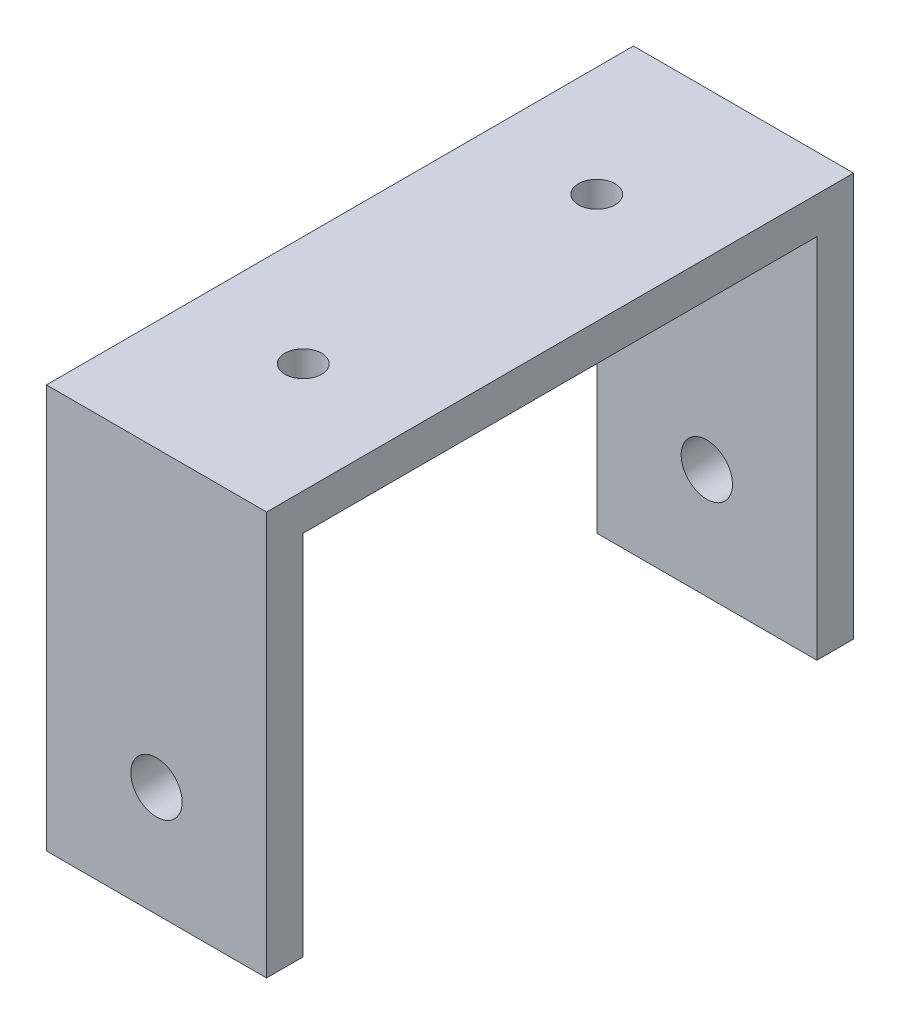
ISO-10303-21;
HEADER;
FILE_DESCRIPTION(('STEP AP214'),'2;1');
FILE_NAME('part.step','',(''),(''),'','','');
FILE_SCHEMA(('AUTOMOTIVE_DESIGN { 1 0 10303 214 1 1 1 1 }'));
ENDSEC;
DATA;
#1=APPLICATION_CONTEXT('core data for automotive mechanical design processes');
#2=APPLICATION_PROTOCOL_DEFINITION('international standard','automotive_design',2000,#1);
#3=PRODUCT_CONTEXT('',#1,'mechanical');
#4=PRODUCT('Part','Part','',(#3));
#5=PRODUCT_RELATED_PRODUCT_CATEGORY('part','',(#4));
#6=PRODUCT_DEFINITION_FORMATION('','',#4);
#7=PRODUCT_DEFINITION_CONTEXT('part definition',#1,'design');
#8=PRODUCT_DEFINITION('design','',#6,#7);
#9=PRODUCT_DEFINITION_SHAPE('','',#8);
#10=(LENGTH_UNIT() NAMED_UNIT(*) SI_UNIT(.MILLI.,.METRE.));
#11=(NAMED_UNIT(*) PLANE_ANGLE_UNIT() SI_UNIT($,.RADIAN.));
#12=(NAMED_UNIT(*) SI_UNIT($,.STERADIAN.) SOLID_ANGLE_UNIT());
#13=UNCERTAINTY_MEASURE_WITH_UNIT(LENGTH_MEASURE(1.E-05),#10,'distance_accuracy_value','');
#14=(GEOMETRIC_REPRESENTATION_CONTEXT(3) GLOBAL_UNCERTAINTY_ASSIGNED_CONTEXT((#13)) GLOBAL_UNIT_ASSIGNED_CONTEXT((#10,
#11,#12)) REPRESENTATION_CONTEXT('',''));
#15=CARTESIAN_POINT('',(0.,0.,0.));
#16=DIRECTION('',(0.,0.,1.));
#17=DIRECTION('',(1.,0.,0.));
#18=AXIS2_PLACEMENT_3D('',#15,#16,#17);
#19=CARTESIAN_POINT('',(-15.,-27.5,80.));
#20=DIRECTION('',(0.,1.,0.));
#21=DIRECTION('',(0.,0.,1.));
#22=AXIS2_PLACEMENT_3D('',#19,#20,#21);
#23=PLANE('',#22);
#24=DIRECTION('',(0.,0.,-1.));
#25=VECTOR('',#24,1.);
#26=CARTESIAN_POINT('',(-15.,-27.5,80.));
#27=LINE('',#26,#25);
#28=CARTESIAN_POINT('',(-15.,-27.5,80.));
#29=VERTEX_POINT('',#28);
#30=CARTESIAN_POINT('',(-15.,-27.5,75.));
#31=VERTEX_POINT('',#30);
#32=EDGE_CURVE('E151',#29,#31,#27,.T.);
#33=ORIENTED_EDGE('',*,*,#32,.T.);
#34=DIRECTION('',(1.,0.,0.));
#35=VECTOR('',#34,1.);
#36=CARTESIAN_POINT('',(-15.,-27.5,75.));
#37=LINE('',#36,#35);
#38=CARTESIAN_POINT('',(15.,-27.5,75.));
#39=VERTEX_POINT('',#38);
#40=EDGE_CURVE('E52',#31,#39,#37,.T.);
#41=ORIENTED_EDGE('',*,*,#40,.T.);
#42=DIRECTION('',(0.,0.,-1.));
#43=VECTOR('',#42,1.);
#44=CARTESIAN_POINT('',(15.,-27.5,80.));
#45=LINE('',#44,#43);
#46=CARTESIAN_POINT('',(15.,-27.5,80.));
#47=VERTEX_POINT('',#46);
#48=EDGE_CURVE('E141',#47,#39,#45,.T.);
#49=ORIENTED_EDGE('',*,*,#48,.F.);
#50=DIRECTION('',(1.,0.,0.));
#51=VECTOR('',#50,1.);
#52=CARTESIAN_POINT('',(-15.,-27.5,80.));
#53=LINE('',#52,#51);
#54=EDGE_CURVE('E69',#29,#47,#53,.T.);
#55=ORIENTED_EDGE('',*,*,#54,.F.);
#56=EDGE_LOOP('',(#33,#41,#49,#55));
#57=FACE_BOUND('',#56,.T.);
#58=ADVANCED_FACE('F42',(#57),#23,.F.);
#59=CARTESIAN_POINT('',(15.,27.5,80.));
#60=DIRECTION('',(-1.,0.,0.));
#61=DIRECTION('',(0.,-1.,0.));
#62=AXIS2_PLACEMENT_3D('',#59,#60,#61);
#63=PLANE('',#62);
#64=ORIENTED_EDGE('',*,*,#48,.T.);
#65=DIRECTION('',(0.,-1.,0.));
#66=VECTOR('',#65,1.);
#67=CARTESIAN_POINT('',(15.,-27.5,75.));
#68=LINE('',#67,#66);
#69=CARTESIAN_POINT('',(15.,22.5,75.));
#70=VERTEX_POINT('',#69);
#71=EDGE_CURVE('E198',#70,#39,#68,.T.);
#72=ORIENTED_EDGE('',*,*,#71,.F.);
#73=DIRECTION('',(0.,0.,1.));
#74=VECTOR('',#73,1.);
#75=CARTESIAN_POINT('',(15.,22.5,75.));
#76=LINE('',#75,#74);
#77=CARTESIAN_POINT('',(15.,22.5,5.));
#78=VERTEX_POINT('',#77);
#79=EDGE_CURVE('E132',#78,#70,#76,.T.);
#80=ORIENTED_EDGE('',*,*,#79,.F.);
#81=DIRECTION('',(0.,1.,0.));
#82=VECTOR('',#81,1.);
#83=CARTESIAN_POINT('',(15.,22.5,5.));
#84=LINE('',#83,#82);
#85=CARTESIAN_POINT('',(15.,-27.5,5.));
#86=VERTEX_POINT('',#85);
#87=EDGE_CURVE('E122',#86,#78,#84,.T.);
#88=ORIENTED_EDGE('',*,*,#87,.F.);
#89=CARTESIAN_POINT('',(15.,-27.5,0.));
#90=VERTEX_POINT('',#89);
#91=EDGE_CURVE('E91',#86,#90,#45,.T.);
#92=ORIENTED_EDGE('',*,*,#91,.T.);
#93=DIRECTION('',(0.,1.,0.));
#94=VECTOR('',#93,1.);
#95=CARTESIAN_POINT('',(15.,27.5,0.));
#96=LINE('',#95,#94);
#97=CARTESIAN_POINT('',(15.,27.5,0.));
#98=VERTEX_POINT('',#97);
#99=EDGE_CURVE('E213',#90,#98,#96,.T.);
#100=ORIENTED_EDGE('',*,*,#99,.T.);
#101=DIRECTION('',(0.,0.,-1.));
#102=VECTOR('',#101,1.);
#103=CARTESIAN_POINT('',(15.,27.5,80.));
#104=LINE('',#103,#102);
#105=CARTESIAN_POINT('',(15.,27.5,80.));
#106=VERTEX_POINT('',#105);
#107=EDGE_CURVE('E127',#106,#98,#104,.T.);
#108=ORIENTED_EDGE('',*,*,#107,.F.);
#109=DIRECTION('',(0.,1.,0.));
#110=VECTOR('',#109,1.);
#111=CARTESIAN_POINT('',(15.,27.5,80.));
#112=LINE('',#111,#110);
#113=EDGE_CURVE('E214',#47,#106,#112,.T.);
#114=ORIENTED_EDGE('',*,*,#113,.F.);
#115=EDGE_LOOP('',(#64,#72,#80,#88,#92,#100,#108,#114));
#116=FACE_BOUND('',#115,.T.);
#117=ADVANCED_FACE('F44',(#116),#63,.F.);
#118=CARTESIAN_POINT('',(-15.,27.5,80.));
#119=DIRECTION('',(0.,-1.,0.));
#120=DIRECTION('',(0.,0.,-1.));
#121=AXIS2_PLACEMENT_3D('',#118,#119,#120);
#122=PLANE('',#121);
#123=CARTESIAN_POINT('',(0.,27.5,20.));
#124=DIRECTION('',(0.,-1.,0.));
#125=DIRECTION('',(0.,0.,-1.));
#126=AXIS2_PLACEMENT_3D('',#123,#124,#125);
#127=CIRCLE('',#126,2.5);
#128=CARTESIAN_POINT('',(0.,27.5,17.5));
#129=VERTEX_POINT('',#128);
#130=EDGE_CURVE('E182',#129,#129,#127,.F.);
#131=ORIENTED_EDGE('',*,*,#130,.F.);
#132=EDGE_LOOP('',(#131));
#133=FACE_BOUND('',#132,.T.);
#134=CARTESIAN_POINT('',(0.,27.5,60.));
#135=DIRECTION('',(0.,-1.,0.));
#136=DIRECTION('',(0.,0.,-1.));
#137=AXIS2_PLACEMENT_3D('',#134,#135,#136);
#138=CIRCLE('',#137,2.5);
#139=CARTESIAN_POINT('',(0.,27.5,57.5));
#140=VERTEX_POINT('',#139);
#141=EDGE_CURVE('E172',#140,#140,#138,.F.);
#142=ORIENTED_EDGE('',*,*,#141,.F.);
#143=EDGE_LOOP('',(#142));
#144=FACE_BOUND('',#143,.T.);
#145=DIRECTION('',(-1.,0.,0.));
#146=VECTOR('',#145,1.);
#147=CARTESIAN_POINT('',(-15.,27.5,0.));
#148=LINE('',#147,#146);
#149=CARTESIAN_POINT('',(-15.,27.5,0.));
#150=VERTEX_POINT('',#149);
#151=EDGE_CURVE('E223',#98,#150,#148,.T.);
#152=ORIENTED_EDGE('',*,*,#151,.T.);
#153=DIRECTION('',(0.,0.,-1.));
#154=VECTOR('',#153,1.);
#155=CARTESIAN_POINT('',(-15.,27.5,80.));
#156=LINE('',#155,#154);
#157=CARTESIAN_POINT('',(-15.,27.5,80.));
#158=VERTEX_POINT('',#157);
#159=EDGE_CURVE('E155',#158,#150,#156,.T.);
#160=ORIENTED_EDGE('',*,*,#159,.F.);
#161=DIRECTION('',(-1.,0.,0.));
#162=VECTOR('',#161,1.);
#163=CARTESIAN_POINT('',(-15.,27.5,80.));
#164=LINE('',#163,#162);
#165=EDGE_CURVE('E99',#106,#158,#164,.T.);
#166=ORIENTED_EDGE('',*,*,#165,.F.);
#167=ORIENTED_EDGE('',*,*,#107,.T.);
#168=EDGE_LOOP('',(#152,#160,#166,#167));
#169=FACE_BOUND('',#168,.T.);
#170=ADVANCED_FACE('F237',(#133,#144,#169),#122,.F.);
#171=CARTESIAN_POINT('',(-15.,27.5,80.));
#172=DIRECTION('',(1.,0.,0.));
#173=DIRECTION('',(0.,1.,0.));
#174=AXIS2_PLACEMENT_3D('',#171,#172,#173);
#175=PLANE('',#174);
#176=DIRECTION('',(0.,0.,1.));
#177=VECTOR('',#176,1.);
#178=CARTESIAN_POINT('',(-15.,22.5,80.));
#179=LINE('',#178,#177);
#180=CARTESIAN_POINT('',(-15.,22.5,5.));
#181=VERTEX_POINT('',#180);
#182=CARTESIAN_POINT('',(-15.,22.5,75.));
#183=VERTEX_POINT('',#182);
#184=EDGE_CURVE('E11',#181,#183,#179,.T.);
#185=ORIENTED_EDGE('',*,*,#184,.T.);
#186=DIRECTION('',(0.,-1.,0.));
#187=VECTOR('',#186,1.);
#188=CARTESIAN_POINT('',(-15.,27.5,75.));
#189=LINE('',#188,#187);
#190=EDGE_CURVE('E209',#183,#31,#189,.T.);
#191=ORIENTED_EDGE('',*,*,#190,.T.);
#192=ORIENTED_EDGE('',*,*,#32,.F.);
#193=DIRECTION('',(0.,-1.,0.));
#194=VECTOR('',#193,1.);
#195=CARTESIAN_POINT('',(-15.,27.5,80.));
#196=LINE('',#195,#194);
#197=EDGE_CURVE('E146',#158,#29,#196,.T.);
#198=ORIENTED_EDGE('',*,*,#197,.F.);
#199=ORIENTED_EDGE('',*,*,#159,.T.);
#200=DIRECTION('',(0.,-1.,0.));
#201=VECTOR('',#200,1.);
#202=CARTESIAN_POINT('',(-15.,27.5,0.));
#203=LINE('',#202,#201);
#204=CARTESIAN_POINT('',(-15.,-27.5,0.));
#205=VERTEX_POINT('',#204);
#206=EDGE_CURVE('E225',#150,#205,#203,.T.);
#207=ORIENTED_EDGE('',*,*,#206,.T.);
#208=CARTESIAN_POINT('',(-15.,-27.5,5.));
#209=VERTEX_POINT('',#208);
#210=EDGE_CURVE('E145',#209,#205,#27,.T.);
#211=ORIENTED_EDGE('',*,*,#210,.F.);
#212=DIRECTION('',(0.,1.,0.));
#213=VECTOR('',#212,1.);
#214=CARTESIAN_POINT('',(-15.,27.5,5.));
#215=LINE('',#214,#213);
#216=EDGE_CURVE('E60',#209,#181,#215,.T.);
#217=ORIENTED_EDGE('',*,*,#216,.T.);
#218=EDGE_LOOP('',(#185,#191,#192,#198,#199,#207,#211,#217));
#219=FACE_BOUND('',#218,.T.);
#220=ADVANCED_FACE('F231',(#219),#175,.F.);
#221=ORIENTED_EDGE('',*,*,#91,.F.);
#222=DIRECTION('',(-1.,0.,0.));
#223=VECTOR('',#222,1.);
#224=CARTESIAN_POINT('',(-15.,-27.5,5.));
#225=LINE('',#224,#223);
#226=EDGE_CURVE('E120',#86,#209,#225,.T.);
#227=ORIENTED_EDGE('',*,*,#226,.T.);
#228=ORIENTED_EDGE('',*,*,#210,.T.);
#229=DIRECTION('',(1.,0.,0.));
#230=VECTOR('',#229,1.);
#231=CARTESIAN_POINT('',(-15.,-27.5,0.));
#232=LINE('',#231,#230);
#233=EDGE_CURVE('E138',#205,#90,#232,.T.);
#234=ORIENTED_EDGE('',*,*,#233,.T.);
#235=EDGE_LOOP('',(#221,#227,#228,#234));
#236=FACE_BOUND('',#235,.T.);
#237=ADVANCED_FACE('F136',(#236),#23,.F.);
#238=CARTESIAN_POINT('',(0.,0.,80.));
#239=DIRECTION('',(0.,0.,1.));
#240=DIRECTION('',(1.,0.,0.));
#241=AXIS2_PLACEMENT_3D('',#238,#239,#240);
#242=PLANE('',#241);
#243=CARTESIAN_POINT('',(0.,-12.5,80.));
#244=DIRECTION('',(0.,0.,1.));
#245=DIRECTION('',(1.,0.,0.));
#246=AXIS2_PLACEMENT_3D('',#243,#244,#245);
#247=CIRCLE('',#246,3.5);
#248=CARTESIAN_POINT('',(3.49999999999999,-12.5,80.));
#249=VERTEX_POINT('',#248);
#250=EDGE_CURVE('E168',#249,#249,#247,.T.);
#251=ORIENTED_EDGE('',*,*,#250,.F.);
#252=EDGE_LOOP('',(#251));
#253=FACE_BOUND('',#252,.T.);
#254=ORIENTED_EDGE('',*,*,#113,.T.);
#255=ORIENTED_EDGE('',*,*,#165,.T.);
#256=ORIENTED_EDGE('',*,*,#197,.T.);
#257=ORIENTED_EDGE('',*,*,#54,.T.);
#258=EDGE_LOOP('',(#254,#255,#256,#257));
#259=FACE_BOUND('',#258,.T.);
#260=ADVANCED_FACE('F239',(#253,#259),#242,.T.);
#261=CARTESIAN_POINT('',(0.,0.,0.));
#262=DIRECTION('',(0.,0.,1.));
#263=DIRECTION('',(1.,0.,0.));
#264=AXIS2_PLACEMENT_3D('',#261,#262,#263);
#265=PLANE('',#264);
#266=CARTESIAN_POINT('',(0.,-12.5,0.));
#267=DIRECTION('',(0.,0.,1.));
#268=DIRECTION('',(1.,0.,0.));
#269=AXIS2_PLACEMENT_3D('',#266,#267,#268);
#270=CIRCLE('',#269,3.5);
#271=CARTESIAN_POINT('',(3.49999999999999,-12.5,0.));
#272=VERTEX_POINT('',#271);
#273=EDGE_CURVE('E134',#272,#272,#270,.T.);
#274=ORIENTED_EDGE('',*,*,#273,.T.);
#275=EDGE_LOOP('',(#274));
#276=FACE_BOUND('',#275,.T.);
#277=ORIENTED_EDGE('',*,*,#99,.F.);
#278=ORIENTED_EDGE('',*,*,#233,.F.);
#279=ORIENTED_EDGE('',*,*,#206,.F.);
#280=ORIENTED_EDGE('',*,*,#151,.F.);
#281=EDGE_LOOP('',(#277,#278,#279,#280));
#282=FACE_BOUND('',#281,.T.);
#283=ADVANCED_FACE('F234',(#276,#282),#265,.F.);
#284=CARTESIAN_POINT('',(-45.,22.5,75.));
#285=DIRECTION('',(0.,1.,0.));
#286=DIRECTION('',(-1.,0.,0.));
#287=AXIS2_PLACEMENT_3D('',#284,#285,#286);
#288=PLANE('',#287);
#289=CARTESIAN_POINT('',(0.,22.5,20.));
#290=DIRECTION('',(0.,1.,0.));
#291=DIRECTION('',(-1.,0.,0.));
#292=AXIS2_PLACEMENT_3D('',#289,#290,#291);
#293=CIRCLE('',#292,2.5);
#294=CARTESIAN_POINT('',(-2.5,22.5,20.));
#295=VERTEX_POINT('',#294);
#296=EDGE_CURVE('E46',#295,#295,#293,.F.);
#297=ORIENTED_EDGE('',*,*,#296,.F.);
#298=EDGE_LOOP('',(#297));
#299=FACE_BOUND('',#298,.T.);
#300=CARTESIAN_POINT('',(0.,22.5,60.));
#301=DIRECTION('',(0.,1.,0.));
#302=DIRECTION('',(-1.,0.,0.));
#303=AXIS2_PLACEMENT_3D('',#300,#301,#302);
#304=CIRCLE('',#303,2.5);
#305=CARTESIAN_POINT('',(-2.5,22.5,60.));
#306=VERTEX_POINT('',#305);
#307=EDGE_CURVE('E169',#306,#306,#304,.F.);
#308=ORIENTED_EDGE('',*,*,#307,.F.);
#309=EDGE_LOOP('',(#308));
#310=FACE_BOUND('',#309,.T.);
#311=DIRECTION('',(1.,0.,0.));
#312=VECTOR('',#311,1.);
#313=CARTESIAN_POINT('',(-45.,22.5,5.));
#314=LINE('',#313,#312);
#315=EDGE_CURVE('E201',#181,#78,#314,.T.);
#316=ORIENTED_EDGE('',*,*,#315,.T.);
#317=ORIENTED_EDGE('',*,*,#79,.T.);
#318=DIRECTION('',(1.,0.,0.));
#319=VECTOR('',#318,1.);
#320=CARTESIAN_POINT('',(-45.,22.5,75.));
#321=LINE('',#320,#319);
#322=EDGE_CURVE('E202',#183,#70,#321,.T.);
#323=ORIENTED_EDGE('',*,*,#322,.F.);
#324=ORIENTED_EDGE('',*,*,#184,.F.);
#325=EDGE_LOOP('',(#316,#317,#323,#324));
#326=FACE_BOUND('',#325,.T.);
#327=ADVANCED_FACE('F247',(#299,#310,#326),#288,.F.);
#328=CARTESIAN_POINT('',(-45.,-27.5,75.));
#329=DIRECTION('',(0.,0.,1.));
#330=DIRECTION('',(1.,0.,0.));
#331=AXIS2_PLACEMENT_3D('',#328,#329,#330);
#332=PLANE('',#331);
#333=CARTESIAN_POINT('',(0.,-12.5,75.));
#334=DIRECTION('',(0.,0.,1.));
#335=DIRECTION('',(1.,0.,0.));
#336=AXIS2_PLACEMENT_3D('',#333,#334,#335);
#337=CIRCLE('',#336,3.5);
#338=CARTESIAN_POINT('',(3.49999999999999,-12.5,75.));
#339=VERTEX_POINT('',#338);
#340=EDGE_CURVE('E167',#339,#339,#337,.T.);
#341=ORIENTED_EDGE('',*,*,#340,.T.);
#342=EDGE_LOOP('',(#341));
#343=FACE_BOUND('',#342,.T.);
#344=ORIENTED_EDGE('',*,*,#322,.T.);
#345=ORIENTED_EDGE('',*,*,#71,.T.);
#346=ORIENTED_EDGE('',*,*,#40,.F.);
#347=ORIENTED_EDGE('',*,*,#190,.F.);
#348=EDGE_LOOP('',(#344,#345,#346,#347));
#349=FACE_BOUND('',#348,.T.);
#350=ADVANCED_FACE('F282',(#343,#349),#332,.F.);
#351=CARTESIAN_POINT('',(-45.,22.5,5.));
#352=DIRECTION('',(0.,0.,-1.));
#353=DIRECTION('',(-1.,0.,0.));
#354=AXIS2_PLACEMENT_3D('',#351,#352,#353);
#355=PLANE('',#354);
#356=CARTESIAN_POINT('',(0.,-12.5,5.));
#357=DIRECTION('',(0.,0.,-1.));
#358=DIRECTION('',(-1.,0.,0.));
#359=AXIS2_PLACEMENT_3D('',#356,#357,#358);
#360=CIRCLE('',#359,3.5);
#361=CARTESIAN_POINT('',(-3.5,-12.5,5.));
#362=VERTEX_POINT('',#361);
#363=EDGE_CURVE('E164',#362,#362,#360,.T.);
#364=ORIENTED_EDGE('',*,*,#363,.T.);
#365=EDGE_LOOP('',(#364));
#366=FACE_BOUND('',#365,.T.);
#367=ORIENTED_EDGE('',*,*,#226,.F.);
#368=ORIENTED_EDGE('',*,*,#87,.T.);
#369=ORIENTED_EDGE('',*,*,#315,.F.);
#370=ORIENTED_EDGE('',*,*,#216,.F.);
#371=EDGE_LOOP('',(#367,#368,#369,#370));
#372=FACE_BOUND('',#371,.T.);
#373=ADVANCED_FACE('F121',(#366,#372),#355,.F.);
#374=CARTESIAN_POINT('',(0.,-12.5,-37.));
#375=DIRECTION('',(0.,0.,1.));
#376=DIRECTION('',(1.,0.,0.));
#377=AXIS2_PLACEMENT_3D('',#374,#375,#376);
#378=CYLINDRICAL_SURFACE('',#377,3.5);
#379=ORIENTED_EDGE('',*,*,#363,.F.);
#380=EDGE_LOOP('',(#379));
#381=FACE_BOUND('',#380,.T.);
#382=ORIENTED_EDGE('',*,*,#273,.F.);
#383=EDGE_LOOP('',(#382));
#384=FACE_BOUND('',#383,.T.);
#385=ADVANCED_FACE('F278',(#381,#384),#378,.F.);
#386=ORIENTED_EDGE('',*,*,#250,.T.);
#387=EDGE_LOOP('',(#386));
#388=FACE_BOUND('',#387,.T.);
#389=ORIENTED_EDGE('',*,*,#340,.F.);
#390=EDGE_LOOP('',(#389));
#391=FACE_BOUND('',#390,.T.);
#392=ADVANCED_FACE('F275',(#388,#391),#378,.F.);
#393=CARTESIAN_POINT('',(0.,42.,60.));
#394=DIRECTION('',(0.,-1.,0.));
#395=DIRECTION('',(0.,0.,-1.));
#396=AXIS2_PLACEMENT_3D('',#393,#394,#395);
#397=CYLINDRICAL_SURFACE('',#396,2.5);
#398=ORIENTED_EDGE('',*,*,#307,.T.);
#399=EDGE_LOOP('',(#398));
#400=FACE_BOUND('',#399,.T.);
#401=ORIENTED_EDGE('',*,*,#141,.T.);
#402=EDGE_LOOP('',(#401));
#403=FACE_BOUND('',#402,.T.);
#404=ADVANCED_FACE('F269',(#400,#403),#397,.F.);
#405=CARTESIAN_POINT('',(0.,42.,20.));
#406=DIRECTION('',(0.,-1.,0.));
#407=DIRECTION('',(0.,0.,-1.));
#408=AXIS2_PLACEMENT_3D('',#405,#406,#407);
#409=CYLINDRICAL_SURFACE('',#408,2.5);
#410=ORIENTED_EDGE('',*,*,#296,.T.);
#411=EDGE_LOOP('',(#410));
#412=FACE_BOUND('',#411,.T.);
#413=ORIENTED_EDGE('',*,*,#130,.T.);
#414=EDGE_LOOP('',(#413));
#415=FACE_BOUND('',#414,.T.);
#416=ADVANCED_FACE('F267',(#412,#415),#409,.F.);
#417=CLOSED_SHELL('',(#58,#117,#170,#220,#237,#260,#283,#327,#350,#373,#385,#392,#404,#416));
#418=MANIFOLD_SOLID_BREP('B2',#417);
#419=ADVANCED_BREP_SHAPE_REPRESENTATION('',(#18,#418),#14);
#420=SHAPE_DEFINITION_REPRESENTATION(#9,#419);
ENDSEC;
END-ISO-10303-21;
